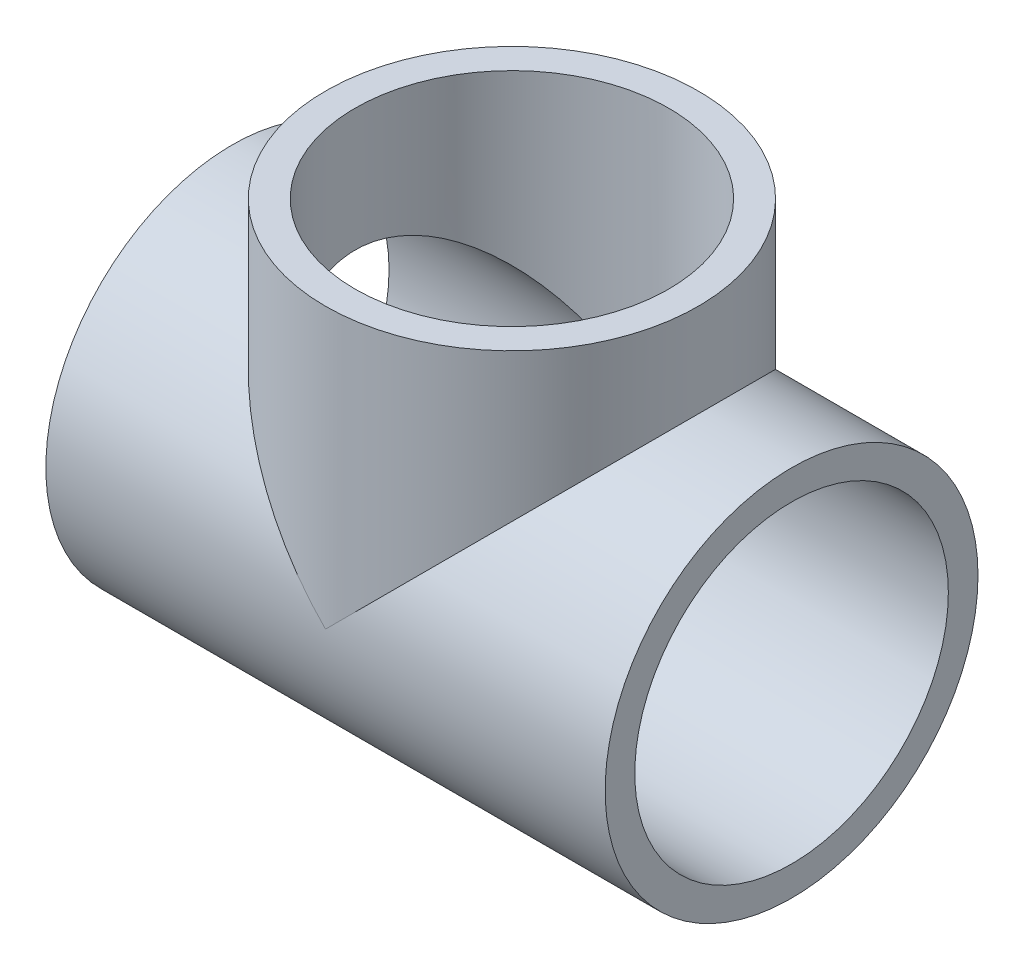
ISO-10303-21;
HEADER;
FILE_DESCRIPTION(('STEP AP214'),'2;1');
FILE_NAME('part.step','',(''),(''),'','','');
FILE_SCHEMA(('AUTOMOTIVE_DESIGN { 1 0 10303 214 1 1 1 1 }'));
ENDSEC;
DATA;
#1=APPLICATION_CONTEXT('core data for automotive mechanical design processes');
#2=APPLICATION_PROTOCOL_DEFINITION('international standard','automotive_design',2000,#1);
#3=PRODUCT_CONTEXT('',#1,'mechanical');
#4=PRODUCT('Part','Part','',(#3));
#5=PRODUCT_RELATED_PRODUCT_CATEGORY('part','',(#4));
#6=PRODUCT_DEFINITION_FORMATION('','',#4);
#7=PRODUCT_DEFINITION_CONTEXT('part definition',#1,'design');
#8=PRODUCT_DEFINITION('design','',#6,#7);
#9=PRODUCT_DEFINITION_SHAPE('','',#8);
#10=(LENGTH_UNIT() NAMED_UNIT(*) SI_UNIT(.MILLI.,.METRE.));
#11=(NAMED_UNIT(*) PLANE_ANGLE_UNIT() SI_UNIT($,.RADIAN.));
#12=(NAMED_UNIT(*) SI_UNIT($,.STERADIAN.) SOLID_ANGLE_UNIT());
#13=UNCERTAINTY_MEASURE_WITH_UNIT(LENGTH_MEASURE(1.E-05),#10,'distance_accuracy_value','');
#14=(GEOMETRIC_REPRESENTATION_CONTEXT(3) GLOBAL_UNCERTAINTY_ASSIGNED_CONTEXT((#13)) GLOBAL_UNIT_ASSIGNED_CONTEXT((#10,
#11,#12)) REPRESENTATION_CONTEXT('',''));
#15=CARTESIAN_POINT('',(0.,0.,0.));
#16=DIRECTION('',(0.,0.,1.));
#17=DIRECTION('',(1.,0.,0.));
#18=AXIS2_PLACEMENT_3D('',#15,#16,#17);
#19=CARTESIAN_POINT('',(-19.05,0.,0.));
#20=DIRECTION('',(1.,0.,0.));
#21=DIRECTION('',(0.,0.,-1.));
#22=AXIS2_PLACEMENT_3D('',#19,#20,#21);
#23=CYLINDRICAL_SURFACE('',#22,12.7);
#24=CARTESIAN_POINT('',(0.,0.,0.));
#25=DIRECTION('',(0.707106781186547,0.707106781186548,0.));
#26=DIRECTION('',(-0.707106781186547,0.707106781186548,0.));
#27=AXIS2_PLACEMENT_3D('',#24,#25,#26);
#28=ELLIPSE('',#27,17.9605122421383,12.7);
#29=CARTESIAN_POINT('',(0.,0.,12.7));
#30=VERTEX_POINT('',#29);
#31=CARTESIAN_POINT('',(0.,0.,-12.7));
#32=VERTEX_POINT('',#31);
#33=EDGE_CURVE('E77',#30,#32,#28,.F.);
#34=ORIENTED_EDGE('',*,*,#33,.T.);
#35=CARTESIAN_POINT('',(0.,0.,0.));
#36=DIRECTION('',(-0.707106781186547,0.707106781186548,0.));
#37=DIRECTION('',(0.707106781186547,0.707106781186548,0.));
#38=AXIS2_PLACEMENT_3D('',#35,#36,#37);
#39=ELLIPSE('',#38,17.9605122421383,12.7);
#40=EDGE_CURVE('E57',#32,#30,#39,.F.);
#41=ORIENTED_EDGE('',*,*,#40,.T.);
#42=EDGE_LOOP('',(#34,#41));
#43=FACE_BOUND('',#42,.T.);
#44=CARTESIAN_POINT('',(-19.05,0.,0.));
#45=DIRECTION('',(1.,0.,0.));
#46=DIRECTION('',(0.,0.,-1.));
#47=AXIS2_PLACEMENT_3D('',#44,#45,#46);
#48=CIRCLE('',#47,12.7);
#49=CARTESIAN_POINT('',(-19.05,0.,-12.7));
#50=VERTEX_POINT('',#49);
#51=EDGE_CURVE('E11',#50,#50,#48,.T.);
#52=ORIENTED_EDGE('',*,*,#51,.T.);
#53=EDGE_LOOP('',(#52));
#54=FACE_BOUND('',#53,.T.);
#55=CARTESIAN_POINT('',(19.05,0.,0.));
#56=DIRECTION('',(1.,0.,0.));
#57=DIRECTION('',(0.,0.,-1.));
#58=AXIS2_PLACEMENT_3D('',#55,#56,#57);
#59=CIRCLE('',#58,12.7);
#60=CARTESIAN_POINT('',(19.05,0.,-12.7));
#61=VERTEX_POINT('',#60);
#62=EDGE_CURVE('E40',#61,#61,#59,.T.);
#63=ORIENTED_EDGE('',*,*,#62,.F.);
#64=EDGE_LOOP('',(#63));
#65=FACE_BOUND('',#64,.T.);
#66=ADVANCED_FACE('F37',(#43,#54,#65),#23,.T.);
#67=CARTESIAN_POINT('',(-19.05,0.,0.));
#68=DIRECTION('',(1.,0.,0.));
#69=DIRECTION('',(0.,0.,-1.));
#70=AXIS2_PLACEMENT_3D('',#67,#68,#69);
#71=PLANE('',#70);
#72=CARTESIAN_POINT('',(-19.05,0.,0.));
#73=DIRECTION('',(1.,0.,0.));
#74=DIRECTION('',(0.,0.,-1.));
#75=AXIS2_PLACEMENT_3D('',#72,#73,#74);
#76=CIRCLE('',#75,10.6807);
#77=CARTESIAN_POINT('',(-19.05,0.,-10.6807));
#78=VERTEX_POINT('',#77);
#79=EDGE_CURVE('E80',#78,#78,#76,.T.);
#80=ORIENTED_EDGE('',*,*,#79,.T.);
#81=EDGE_LOOP('',(#80));
#82=FACE_BOUND('',#81,.T.);
#83=ORIENTED_EDGE('',*,*,#51,.F.);
#84=EDGE_LOOP('',(#83));
#85=FACE_BOUND('',#84,.T.);
#86=ADVANCED_FACE('F90',(#82,#85),#71,.F.);
#87=CARTESIAN_POINT('',(19.05,0.,0.));
#88=DIRECTION('',(1.,0.,0.));
#89=DIRECTION('',(0.,0.,-1.));
#90=AXIS2_PLACEMENT_3D('',#87,#88,#89);
#91=PLANE('',#90);
#92=CARTESIAN_POINT('',(19.05,0.,0.));
#93=DIRECTION('',(1.,0.,0.));
#94=DIRECTION('',(0.,0.,-1.));
#95=AXIS2_PLACEMENT_3D('',#92,#93,#94);
#96=CIRCLE('',#95,10.6807);
#97=CARTESIAN_POINT('',(19.05,0.,-10.6807));
#98=VERTEX_POINT('',#97);
#99=EDGE_CURVE('E79',#98,#98,#96,.T.);
#100=ORIENTED_EDGE('',*,*,#99,.F.);
#101=EDGE_LOOP('',(#100));
#102=FACE_BOUND('',#101,.T.);
#103=ORIENTED_EDGE('',*,*,#62,.T.);
#104=EDGE_LOOP('',(#103));
#105=FACE_BOUND('',#104,.T.);
#106=ADVANCED_FACE('F87',(#102,#105),#91,.T.);
#107=CARTESIAN_POINT('',(-19.05,0.,0.));
#108=DIRECTION('',(1.,0.,0.));
#109=DIRECTION('',(0.,0.,-1.));
#110=AXIS2_PLACEMENT_3D('',#107,#108,#109);
#111=CYLINDRICAL_SURFACE('',#110,10.6807);
#112=CARTESIAN_POINT('',(0.,0.,0.));
#113=DIRECTION('',(-0.707106781186547,0.707106781186548,0.));
#114=DIRECTION('',(0.707106781186547,0.707106781186548,0.));
#115=AXIS2_PLACEMENT_3D('',#112,#113,#114);
#116=ELLIPSE('',#115,15.1047907956383,10.6807);
#117=CARTESIAN_POINT('',(0.,0.,-10.6807));
#118=VERTEX_POINT('',#117);
#119=CARTESIAN_POINT('',(0.,0.,10.6807));
#120=VERTEX_POINT('',#119);
#121=EDGE_CURVE('E62',#118,#120,#116,.F.);
#122=ORIENTED_EDGE('',*,*,#121,.F.);
#123=CARTESIAN_POINT('',(0.,0.,0.));
#124=DIRECTION('',(0.707106781186547,0.707106781186548,0.));
#125=DIRECTION('',(-0.707106781186547,0.707106781186548,0.));
#126=AXIS2_PLACEMENT_3D('',#123,#124,#125);
#127=ELLIPSE('',#126,15.1047907956383,10.6807);
#128=EDGE_CURVE('E50',#120,#118,#127,.F.);
#129=ORIENTED_EDGE('',*,*,#128,.F.);
#130=EDGE_LOOP('',(#122,#129));
#131=FACE_BOUND('',#130,.T.);
#132=ORIENTED_EDGE('',*,*,#79,.F.);
#133=EDGE_LOOP('',(#132));
#134=FACE_BOUND('',#133,.T.);
#135=ORIENTED_EDGE('',*,*,#99,.T.);
#136=EDGE_LOOP('',(#135));
#137=FACE_BOUND('',#136,.T.);
#138=ADVANCED_FACE('F66',(#131,#134,#137),#111,.F.);
#139=CARTESIAN_POINT('',(0.,19.05,0.));
#140=DIRECTION('',(0.,1.,0.));
#141=DIRECTION('',(0.,0.,1.));
#142=AXIS2_PLACEMENT_3D('',#139,#140,#141);
#143=PLANE('',#142);
#144=CARTESIAN_POINT('',(0.,19.05,0.));
#145=DIRECTION('',(0.,1.,0.));
#146=DIRECTION('',(0.,0.,1.));
#147=AXIS2_PLACEMENT_3D('',#144,#145,#146);
#148=CIRCLE('',#147,10.6807);
#149=CARTESIAN_POINT('',(0.,19.05,10.6807));
#150=VERTEX_POINT('',#149);
#151=EDGE_CURVE('E68',#150,#150,#148,.T.);
#152=ORIENTED_EDGE('',*,*,#151,.F.);
#153=EDGE_LOOP('',(#152));
#154=FACE_BOUND('',#153,.T.);
#155=CARTESIAN_POINT('',(0.,19.05,0.));
#156=DIRECTION('',(0.,1.,0.));
#157=DIRECTION('',(0.,0.,1.));
#158=AXIS2_PLACEMENT_3D('',#155,#156,#157);
#159=CIRCLE('',#158,12.7);
#160=CARTESIAN_POINT('',(0.,19.05,12.7));
#161=VERTEX_POINT('',#160);
#162=EDGE_CURVE('E71',#161,#161,#159,.T.);
#163=ORIENTED_EDGE('',*,*,#162,.T.);
#164=EDGE_LOOP('',(#163));
#165=FACE_BOUND('',#164,.T.);
#166=ADVANCED_FACE('F107',(#154,#165),#143,.T.);
#167=CARTESIAN_POINT('',(0.,-12.701,0.));
#168=DIRECTION('',(0.,1.,0.));
#169=DIRECTION('',(0.,0.,1.));
#170=AXIS2_PLACEMENT_3D('',#167,#168,#169);
#171=CYLINDRICAL_SURFACE('',#170,12.7);
#172=ORIENTED_EDGE('',*,*,#33,.F.);
#173=ORIENTED_EDGE('',*,*,#40,.F.);
#174=EDGE_LOOP('',(#172,#173));
#175=FACE_BOUND('',#174,.T.);
#176=ORIENTED_EDGE('',*,*,#162,.F.);
#177=EDGE_LOOP('',(#176));
#178=FACE_BOUND('',#177,.T.);
#179=ADVANCED_FACE('F104',(#175,#178),#171,.T.);
#180=CARTESIAN_POINT('',(0.,-12.701,0.));
#181=DIRECTION('',(0.,1.,0.));
#182=DIRECTION('',(0.,0.,1.));
#183=AXIS2_PLACEMENT_3D('',#180,#181,#182);
#184=CYLINDRICAL_SURFACE('',#183,10.6807);
#185=ORIENTED_EDGE('',*,*,#151,.T.);
#186=EDGE_LOOP('',(#185));
#187=FACE_BOUND('',#186,.T.);
#188=ORIENTED_EDGE('',*,*,#128,.T.);
#189=ORIENTED_EDGE('',*,*,#121,.T.);
#190=EDGE_LOOP('',(#188,#189));
#191=FACE_BOUND('',#190,.T.);
#192=ADVANCED_FACE('F63',(#187,#191),#184,.F.);
#193=CLOSED_SHELL('',(#66,#86,#106,#138,#166,#179,#192));
#194=MANIFOLD_SOLID_BREP('B2',#193);
#195=ADVANCED_BREP_SHAPE_REPRESENTATION('',(#18,#194),#14);
#196=SHAPE_DEFINITION_REPRESENTATION(#9,#195);
ENDSEC;
END-ISO-10303-21;
